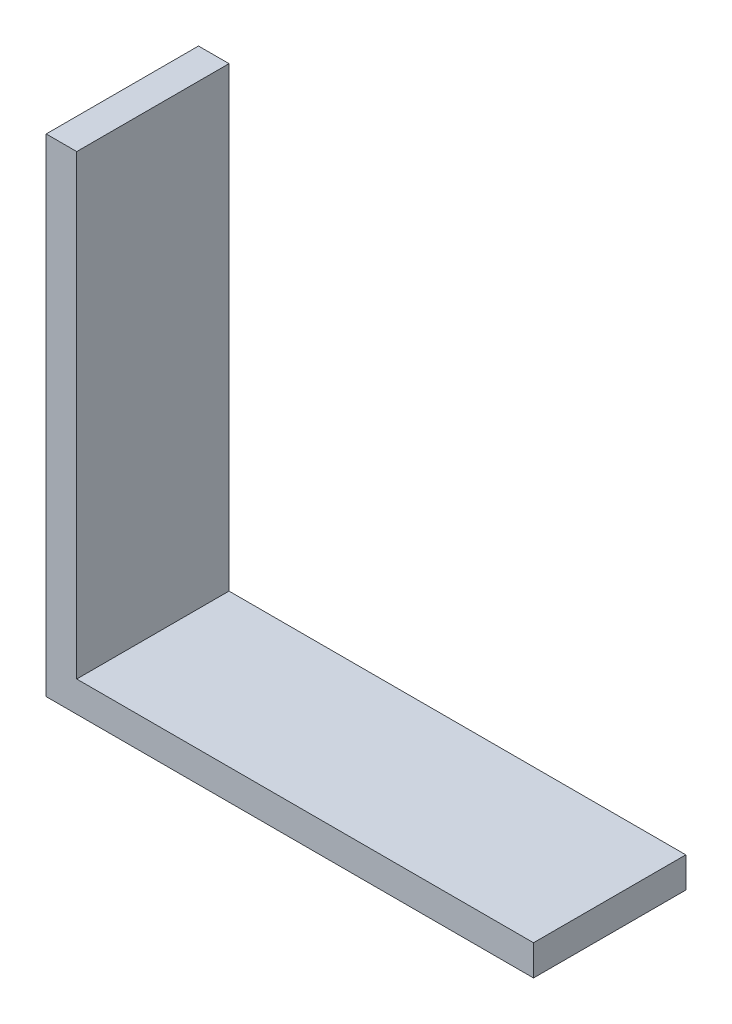
ISO-10303-21;
HEADER;
FILE_DESCRIPTION(('STEP AP214'),'2;1');
FILE_NAME('part.step','',(''),(''),'','','');
FILE_SCHEMA(('AUTOMOTIVE_DESIGN { 1 0 10303 214 1 1 1 1 }'));
ENDSEC;
DATA;
#1=APPLICATION_CONTEXT('core data for automotive mechanical design processes');
#2=APPLICATION_PROTOCOL_DEFINITION('international standard','automotive_design',2000,#1);
#3=PRODUCT_CONTEXT('',#1,'mechanical');
#4=PRODUCT('Part','Part','',(#3));
#5=PRODUCT_RELATED_PRODUCT_CATEGORY('part','',(#4));
#6=PRODUCT_DEFINITION_FORMATION('','',#4);
#7=PRODUCT_DEFINITION_CONTEXT('part definition',#1,'design');
#8=PRODUCT_DEFINITION('design','',#6,#7);
#9=PRODUCT_DEFINITION_SHAPE('','',#8);
#10=(LENGTH_UNIT() NAMED_UNIT(*) SI_UNIT(.MILLI.,.METRE.));
#11=(NAMED_UNIT(*) PLANE_ANGLE_UNIT() SI_UNIT($,.RADIAN.));
#12=(NAMED_UNIT(*) SI_UNIT($,.STERADIAN.) SOLID_ANGLE_UNIT());
#13=UNCERTAINTY_MEASURE_WITH_UNIT(LENGTH_MEASURE(1.E-05),#10,'distance_accuracy_value','');
#14=(GEOMETRIC_REPRESENTATION_CONTEXT(3) GLOBAL_UNCERTAINTY_ASSIGNED_CONTEXT((#13)) GLOBAL_UNIT_ASSIGNED_CONTEXT((#10,
#11,#12)) REPRESENTATION_CONTEXT('',''));
#15=CARTESIAN_POINT('',(0.,0.,0.));
#16=DIRECTION('',(0.,0.,1.));
#17=DIRECTION('',(1.,0.,0.));
#18=AXIS2_PLACEMENT_3D('',#15,#16,#17);
#19=CARTESIAN_POINT('',(0.,0.,11.90625));
#20=DIRECTION('',(0.,1.,0.));
#21=DIRECTION('',(0.,0.,1.));
#22=AXIS2_PLACEMENT_3D('',#19,#20,#21);
#23=PLANE('',#22);
#24=DIRECTION('',(1.,0.,0.));
#25=VECTOR('',#24,1.);
#26=CARTESIAN_POINT('',(0.,0.,-11.90625));
#27=LINE('',#26,#25);
#28=CARTESIAN_POINT('',(0.,0.,-11.90625));
#29=VERTEX_POINT('',#28);
#30=CARTESIAN_POINT('',(76.2,0.,-11.90625));
#31=VERTEX_POINT('',#30);
#32=EDGE_CURVE('E118',#29,#31,#27,.T.);
#33=ORIENTED_EDGE('',*,*,#32,.T.);
#34=DIRECTION('',(0.,0.,-1.));
#35=VECTOR('',#34,1.);
#36=CARTESIAN_POINT('',(76.2,0.,11.90625));
#37=LINE('',#36,#35);
#38=CARTESIAN_POINT('',(76.2,0.,11.90625));
#39=VERTEX_POINT('',#38);
#40=EDGE_CURVE('E11',#39,#31,#37,.T.);
#41=ORIENTED_EDGE('',*,*,#40,.F.);
#42=DIRECTION('',(1.,0.,0.));
#43=VECTOR('',#42,1.);
#44=CARTESIAN_POINT('',(0.,0.,11.90625));
#45=LINE('',#44,#43);
#46=CARTESIAN_POINT('',(0.,0.,11.90625));
#47=VERTEX_POINT('',#46);
#48=EDGE_CURVE('E128',#47,#39,#45,.T.);
#49=ORIENTED_EDGE('',*,*,#48,.F.);
#50=DIRECTION('',(0.,0.,-1.));
#51=VECTOR('',#50,1.);
#52=CARTESIAN_POINT('',(0.,0.,11.90625));
#53=LINE('',#52,#51);
#54=EDGE_CURVE('E114',#47,#29,#53,.T.);
#55=ORIENTED_EDGE('',*,*,#54,.T.);
#56=EDGE_LOOP('',(#33,#41,#49,#55));
#57=FACE_BOUND('',#56,.T.);
#58=ADVANCED_FACE('F34',(#57),#23,.F.);
#59=CARTESIAN_POINT('',(76.2,4.7752,11.90625));
#60=DIRECTION('',(-1.,0.,0.));
#61=DIRECTION('',(0.,0.,1.));
#62=AXIS2_PLACEMENT_3D('',#59,#60,#61);
#63=PLANE('',#62);
#64=DIRECTION('',(0.,1.,0.));
#65=VECTOR('',#64,1.);
#66=CARTESIAN_POINT('',(76.2,4.7752,-11.90625));
#67=LINE('',#66,#65);
#68=CARTESIAN_POINT('',(76.2,4.7752,-11.90625));
#69=VERTEX_POINT('',#68);
#70=EDGE_CURVE('E121',#31,#69,#67,.T.);
#71=ORIENTED_EDGE('',*,*,#70,.T.);
#72=DIRECTION('',(0.,0.,-1.));
#73=VECTOR('',#72,1.);
#74=CARTESIAN_POINT('',(76.2,4.7752,11.90625));
#75=LINE('',#74,#73);
#76=CARTESIAN_POINT('',(76.2,4.7752,11.90625));
#77=VERTEX_POINT('',#76);
#78=EDGE_CURVE('E42',#77,#69,#75,.T.);
#79=ORIENTED_EDGE('',*,*,#78,.F.);
#80=DIRECTION('',(0.,1.,0.));
#81=VECTOR('',#80,1.);
#82=CARTESIAN_POINT('',(76.2,4.7752,11.90625));
#83=LINE('',#82,#81);
#84=EDGE_CURVE('E87',#39,#77,#83,.T.);
#85=ORIENTED_EDGE('',*,*,#84,.F.);
#86=ORIENTED_EDGE('',*,*,#40,.T.);
#87=EDGE_LOOP('',(#71,#79,#85,#86));
#88=FACE_BOUND('',#87,.T.);
#89=ADVANCED_FACE('F152',(#88),#63,.F.);
#90=CARTESIAN_POINT('',(4.77520000000001,4.7752,11.90625));
#91=DIRECTION('',(0.,-1.,0.));
#92=DIRECTION('',(0.,0.,-1.));
#93=AXIS2_PLACEMENT_3D('',#90,#91,#92);
#94=PLANE('',#93);
#95=DIRECTION('',(-1.,0.,0.));
#96=VECTOR('',#95,1.);
#97=CARTESIAN_POINT('',(4.77520000000001,4.7752,-11.90625));
#98=LINE('',#97,#96);
#99=CARTESIAN_POINT('',(4.77520000000001,4.7752,-11.90625));
#100=VERTEX_POINT('',#99);
#101=EDGE_CURVE('E123',#69,#100,#98,.T.);
#102=ORIENTED_EDGE('',*,*,#101,.T.);
#103=DIRECTION('',(0.,0.,-1.));
#104=VECTOR('',#103,1.);
#105=CARTESIAN_POINT('',(4.77520000000001,4.7752,11.90625));
#106=LINE('',#105,#104);
#107=CARTESIAN_POINT('',(4.77520000000001,4.7752,11.90625));
#108=VERTEX_POINT('',#107);
#109=EDGE_CURVE('E109',#108,#100,#106,.T.);
#110=ORIENTED_EDGE('',*,*,#109,.F.);
#111=DIRECTION('',(-1.,0.,0.));
#112=VECTOR('',#111,1.);
#113=CARTESIAN_POINT('',(4.77520000000001,4.7752,11.90625));
#114=LINE('',#113,#112);
#115=EDGE_CURVE('E100',#77,#108,#114,.T.);
#116=ORIENTED_EDGE('',*,*,#115,.F.);
#117=ORIENTED_EDGE('',*,*,#78,.T.);
#118=EDGE_LOOP('',(#102,#110,#116,#117));
#119=FACE_BOUND('',#118,.T.);
#120=ADVANCED_FACE('F134',(#119),#94,.F.);
#121=CARTESIAN_POINT('',(4.7752,76.2,11.90625));
#122=DIRECTION('',(-1.,0.,0.));
#123=DIRECTION('',(0.,-1.,0.));
#124=AXIS2_PLACEMENT_3D('',#121,#122,#123);
#125=PLANE('',#124);
#126=DIRECTION('',(0.,1.,0.));
#127=VECTOR('',#126,1.);
#128=CARTESIAN_POINT('',(4.7752,76.2,-11.90625));
#129=LINE('',#128,#127);
#130=CARTESIAN_POINT('',(4.7752,76.2,-11.90625));
#131=VERTEX_POINT('',#130);
#132=EDGE_CURVE('E108',#100,#131,#129,.T.);
#133=ORIENTED_EDGE('',*,*,#132,.T.);
#134=DIRECTION('',(0.,0.,-1.));
#135=VECTOR('',#134,1.);
#136=CARTESIAN_POINT('',(4.7752,76.2,11.90625));
#137=LINE('',#136,#135);
#138=CARTESIAN_POINT('',(4.7752,76.2,11.90625));
#139=VERTEX_POINT('',#138);
#140=EDGE_CURVE('E105',#139,#131,#137,.T.);
#141=ORIENTED_EDGE('',*,*,#140,.F.);
#142=DIRECTION('',(0.,1.,0.));
#143=VECTOR('',#142,1.);
#144=CARTESIAN_POINT('',(4.7752,76.2,11.90625));
#145=LINE('',#144,#143);
#146=EDGE_CURVE('E94',#108,#139,#145,.T.);
#147=ORIENTED_EDGE('',*,*,#146,.F.);
#148=ORIENTED_EDGE('',*,*,#109,.T.);
#149=EDGE_LOOP('',(#133,#141,#147,#148));
#150=FACE_BOUND('',#149,.T.);
#151=ADVANCED_FACE('F106',(#150),#125,.F.);
#152=CARTESIAN_POINT('',(0.,76.2,11.90625));
#153=DIRECTION('',(0.,-1.,0.));
#154=DIRECTION('',(0.,0.,-1.));
#155=AXIS2_PLACEMENT_3D('',#152,#153,#154);
#156=PLANE('',#155);
#157=DIRECTION('',(-1.,0.,0.));
#158=VECTOR('',#157,1.);
#159=CARTESIAN_POINT('',(0.,76.2,-11.90625));
#160=LINE('',#159,#158);
#161=CARTESIAN_POINT('',(0.,76.2,-11.90625));
#162=VERTEX_POINT('',#161);
#163=EDGE_CURVE('E73',#131,#162,#160,.T.);
#164=ORIENTED_EDGE('',*,*,#163,.T.);
#165=DIRECTION('',(0.,0.,-1.));
#166=VECTOR('',#165,1.);
#167=CARTESIAN_POINT('',(0.,76.2,11.90625));
#168=LINE('',#167,#166);
#169=CARTESIAN_POINT('',(0.,76.2,11.90625));
#170=VERTEX_POINT('',#169);
#171=EDGE_CURVE('E110',#170,#162,#168,.T.);
#172=ORIENTED_EDGE('',*,*,#171,.F.);
#173=DIRECTION('',(-1.,0.,0.));
#174=VECTOR('',#173,1.);
#175=CARTESIAN_POINT('',(0.,76.2,11.90625));
#176=LINE('',#175,#174);
#177=EDGE_CURVE('E98',#139,#170,#176,.T.);
#178=ORIENTED_EDGE('',*,*,#177,.F.);
#179=ORIENTED_EDGE('',*,*,#140,.T.);
#180=EDGE_LOOP('',(#164,#172,#178,#179));
#181=FACE_BOUND('',#180,.T.);
#182=ADVANCED_FACE('F112',(#181),#156,.F.);
#183=CARTESIAN_POINT('',(0.,0.,11.90625));
#184=DIRECTION('',(1.,0.,0.));
#185=DIRECTION('',(0.,0.,-1.));
#186=AXIS2_PLACEMENT_3D('',#183,#184,#185);
#187=PLANE('',#186);
#188=DIRECTION('',(0.,-1.,0.));
#189=VECTOR('',#188,1.);
#190=CARTESIAN_POINT('',(0.,0.,-11.90625));
#191=LINE('',#190,#189);
#192=EDGE_CURVE('E79',#162,#29,#191,.T.);
#193=ORIENTED_EDGE('',*,*,#192,.T.);
#194=ORIENTED_EDGE('',*,*,#54,.F.);
#195=DIRECTION('',(0.,-1.,0.));
#196=VECTOR('',#195,1.);
#197=CARTESIAN_POINT('',(0.,0.,11.90625));
#198=LINE('',#197,#196);
#199=EDGE_CURVE('E50',#170,#47,#198,.T.);
#200=ORIENTED_EDGE('',*,*,#199,.F.);
#201=ORIENTED_EDGE('',*,*,#171,.T.);
#202=EDGE_LOOP('',(#193,#194,#200,#201));
#203=FACE_BOUND('',#202,.T.);
#204=ADVANCED_FACE('F141',(#203),#187,.F.);
#205=CARTESIAN_POINT('',(0.,0.,11.90625));
#206=DIRECTION('',(0.,0.,-1.));
#207=DIRECTION('',(-1.,0.,0.));
#208=AXIS2_PLACEMENT_3D('',#205,#206,#207);
#209=PLANE('',#208);
#210=ORIENTED_EDGE('',*,*,#48,.T.);
#211=ORIENTED_EDGE('',*,*,#84,.T.);
#212=ORIENTED_EDGE('',*,*,#115,.T.);
#213=ORIENTED_EDGE('',*,*,#146,.T.);
#214=ORIENTED_EDGE('',*,*,#177,.T.);
#215=ORIENTED_EDGE('',*,*,#199,.T.);
#216=EDGE_LOOP('',(#210,#211,#212,#213,#214,#215));
#217=FACE_BOUND('',#216,.T.);
#218=ADVANCED_FACE('F96',(#217),#209,.F.);
#219=CARTESIAN_POINT('',(0.,0.,-11.90625));
#220=DIRECTION('',(0.,0.,-1.));
#221=DIRECTION('',(-1.,0.,0.));
#222=AXIS2_PLACEMENT_3D('',#219,#220,#221);
#223=PLANE('',#222);
#224=ORIENTED_EDGE('',*,*,#32,.F.);
#225=ORIENTED_EDGE('',*,*,#192,.F.);
#226=ORIENTED_EDGE('',*,*,#163,.F.);
#227=ORIENTED_EDGE('',*,*,#132,.F.);
#228=ORIENTED_EDGE('',*,*,#101,.F.);
#229=ORIENTED_EDGE('',*,*,#70,.F.);
#230=EDGE_LOOP('',(#224,#225,#226,#227,#228,#229));
#231=FACE_BOUND('',#230,.T.);
#232=ADVANCED_FACE('F137',(#231),#223,.T.);
#233=CLOSED_SHELL('',(#58,#89,#120,#151,#182,#204,#218,#232));
#234=MANIFOLD_SOLID_BREP('B2',#233);
#235=ADVANCED_BREP_SHAPE_REPRESENTATION('',(#18,#234),#14);
#236=SHAPE_DEFINITION_REPRESENTATION(#9,#235);
ENDSEC;
END-ISO-10303-21;
